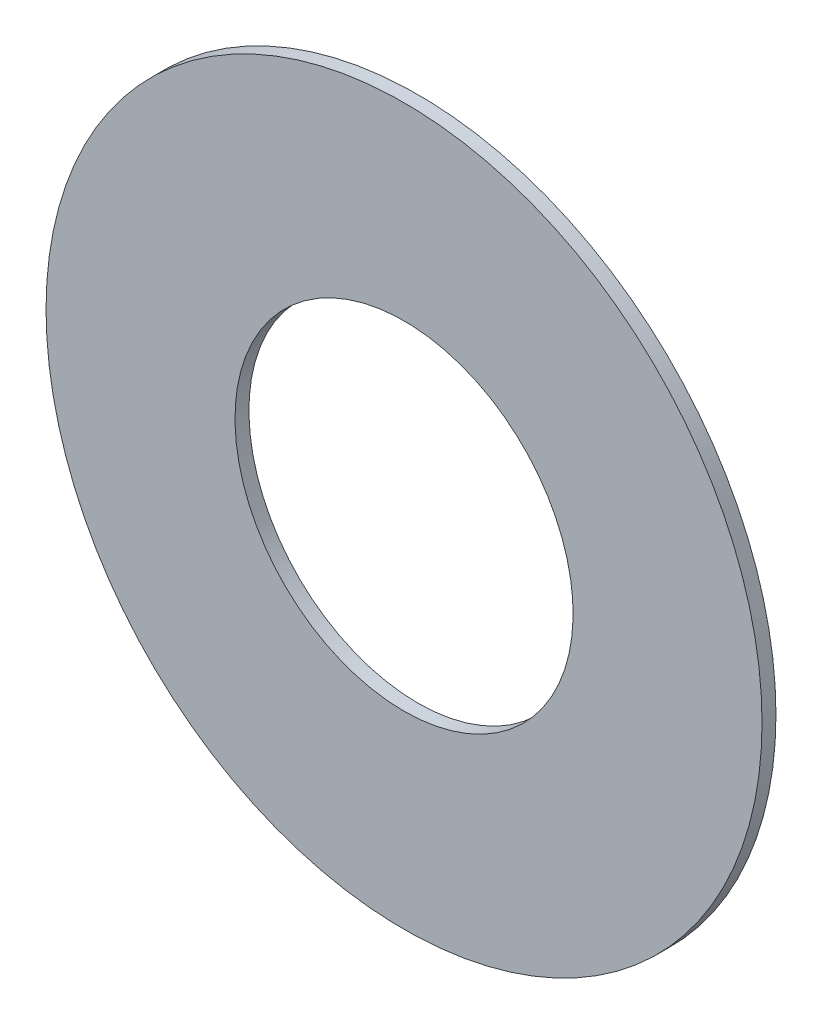
ISO-10303-21;
HEADER;
FILE_DESCRIPTION(('STEP AP214'),'2;1');
FILE_NAME('part.step','',(''),(''),'','','');
FILE_SCHEMA(('AUTOMOTIVE_DESIGN { 1 0 10303 214 1 1 1 1 }'));
ENDSEC;
DATA;
#1=APPLICATION_CONTEXT('core data for automotive mechanical design processes');
#2=APPLICATION_PROTOCOL_DEFINITION('international standard','automotive_design',2000,#1);
#3=PRODUCT_CONTEXT('',#1,'mechanical');
#4=PRODUCT('Part','Part','',(#3));
#5=PRODUCT_RELATED_PRODUCT_CATEGORY('part','',(#4));
#6=PRODUCT_DEFINITION_FORMATION('','',#4);
#7=PRODUCT_DEFINITION_CONTEXT('part definition',#1,'design');
#8=PRODUCT_DEFINITION('design','',#6,#7);
#9=PRODUCT_DEFINITION_SHAPE('','',#8);
#10=(LENGTH_UNIT() NAMED_UNIT(*) SI_UNIT(.MILLI.,.METRE.));
#11=(NAMED_UNIT(*) PLANE_ANGLE_UNIT() SI_UNIT($,.RADIAN.));
#12=(NAMED_UNIT(*) SI_UNIT($,.STERADIAN.) SOLID_ANGLE_UNIT());
#13=UNCERTAINTY_MEASURE_WITH_UNIT(LENGTH_MEASURE(1.E-05),#10,'distance_accuracy_value','');
#14=(GEOMETRIC_REPRESENTATION_CONTEXT(3) GLOBAL_UNCERTAINTY_ASSIGNED_CONTEXT((#13)) GLOBAL_UNIT_ASSIGNED_CONTEXT((#10,
#11,#12)) REPRESENTATION_CONTEXT('',''));
#15=CARTESIAN_POINT('',(0.,0.,0.));
#16=DIRECTION('',(0.,0.,1.));
#17=DIRECTION('',(1.,0.,0.));
#18=AXIS2_PLACEMENT_3D('',#15,#16,#17);
#19=CARTESIAN_POINT('',(170.3578,-71.2108,-0.045));
#20=DIRECTION('',(0.,0.,-1.));
#21=DIRECTION('',(0.,-1.,0.));
#22=AXIS2_PLACEMENT_3D('',#19,#20,#21);
#23=CYLINDRICAL_SURFACE('',#22,0.425);
#24=CARTESIAN_POINT('',(170.3578,-71.2108,-0.035));
#25=DIRECTION('',(0.,0.,-1.));
#26=DIRECTION('',(0.,-1.,0.));
#27=AXIS2_PLACEMENT_3D('',#24,#25,#26);
#28=CIRCLE('',#27,0.425);
#29=CARTESIAN_POINT('',(170.3578,-71.6358,-0.035));
#30=VERTEX_POINT('',#29);
#31=EDGE_CURVE('E25',#30,#30,#28,.T.);
#32=ORIENTED_EDGE('',*,*,#31,.T.);
#33=DIRECTION('',(0.,0.,1.));
#34=VECTOR('',#33,1.);
#35=CARTESIAN_POINT('',(170.3578,-71.6358,-0.045));
#36=LINE('',#35,#34);
#37=CARTESIAN_POINT('',(170.3578,-71.6358,0.));
#38=VERTEX_POINT('',#37);
#39=EDGE_CURVE('E11',#30,#38,#36,.T.);
#40=ORIENTED_EDGE('',*,*,#39,.T.);
#41=CARTESIAN_POINT('',(170.3578,-71.2108,0.));
#42=DIRECTION('',(0.,0.,-1.));
#43=DIRECTION('',(0.,-1.,0.));
#44=AXIS2_PLACEMENT_3D('',#41,#42,#43);
#45=CIRCLE('',#44,0.425);
#46=EDGE_CURVE('E69',#38,#38,#45,.T.);
#47=ORIENTED_EDGE('',*,*,#46,.F.);
#48=ORIENTED_EDGE('',*,*,#39,.F.);
#49=EDGE_LOOP('',(#32,#40,#47,#48));
#50=FACE_BOUND('',#49,.T.);
#51=ADVANCED_FACE('F17',(#50),#23,.F.);
#52=CARTESIAN_POINT('',(170.3578,-71.2108,-0.035));
#53=DIRECTION('',(0.,0.,1.));
#54=DIRECTION('',(1.,0.,0.));
#55=AXIS2_PLACEMENT_3D('',#52,#53,#54);
#56=PLANE('',#55);
#57=ORIENTED_EDGE('',*,*,#31,.F.);
#58=EDGE_LOOP('',(#57));
#59=FACE_BOUND('',#58,.T.);
#60=CARTESIAN_POINT('',(170.3578,-71.2108,-0.035));
#61=DIRECTION('',(0.,0.,1.));
#62=DIRECTION('',(1.,0.,0.));
#63=AXIS2_PLACEMENT_3D('',#60,#61,#62);
#64=CIRCLE('',#63,0.9);
#65=CARTESIAN_POINT('',(171.2578,-71.2108,-0.035));
#66=VERTEX_POINT('',#65);
#67=EDGE_CURVE('E56',#66,#66,#64,.T.);
#68=ORIENTED_EDGE('',*,*,#67,.F.);
#69=EDGE_LOOP('',(#68));
#70=FACE_BOUND('',#69,.T.);
#71=ADVANCED_FACE('F76',(#59,#70),#56,.F.);
#72=CARTESIAN_POINT('',(170.3578,-71.2108,0.));
#73=DIRECTION('',(0.,0.,1.));
#74=DIRECTION('',(1.,0.,0.));
#75=AXIS2_PLACEMENT_3D('',#72,#73,#74);
#76=PLANE('',#75);
#77=ORIENTED_EDGE('',*,*,#46,.T.);
#78=EDGE_LOOP('',(#77));
#79=FACE_BOUND('',#78,.T.);
#80=CARTESIAN_POINT('',(170.3578,-71.2108,0.));
#81=DIRECTION('',(0.,0.,1.));
#82=DIRECTION('',(1.,0.,0.));
#83=AXIS2_PLACEMENT_3D('',#80,#81,#82);
#84=CIRCLE('',#83,0.9);
#85=CARTESIAN_POINT('',(171.2578,-71.2108,0.));
#86=VERTEX_POINT('',#85);
#87=EDGE_CURVE('E54',#86,#86,#84,.T.);
#88=ORIENTED_EDGE('',*,*,#87,.T.);
#89=EDGE_LOOP('',(#88));
#90=FACE_BOUND('',#89,.T.);
#91=ADVANCED_FACE('F60',(#79,#90),#76,.T.);
#92=CARTESIAN_POINT('',(170.3578,-71.2108,-0.035));
#93=DIRECTION('',(0.,0.,1.));
#94=DIRECTION('',(1.,0.,0.));
#95=AXIS2_PLACEMENT_3D('',#92,#93,#94);
#96=CYLINDRICAL_SURFACE('',#95,0.9);
#97=ORIENTED_EDGE('',*,*,#87,.F.);
#98=DIRECTION('',(0.,0.,1.));
#99=VECTOR('',#98,1.);
#100=CARTESIAN_POINT('',(171.2578,-71.2108,-0.035));
#101=LINE('',#100,#99);
#102=EDGE_CURVE('E51',#66,#86,#101,.T.);
#103=ORIENTED_EDGE('',*,*,#102,.F.);
#104=ORIENTED_EDGE('',*,*,#67,.T.);
#105=ORIENTED_EDGE('',*,*,#102,.T.);
#106=EDGE_LOOP('',(#97,#103,#104,#105));
#107=FACE_BOUND('',#106,.T.);
#108=ADVANCED_FACE('F53',(#107),#96,.T.);
#109=CLOSED_SHELL('',(#51,#71,#91,#108));
#110=MANIFOLD_SOLID_BREP('B1',#109);
#111=ADVANCED_BREP_SHAPE_REPRESENTATION('',(#18,#110),#14);
#112=SHAPE_DEFINITION_REPRESENTATION(#9,#111);
ENDSEC;
END-ISO-10303-21;
